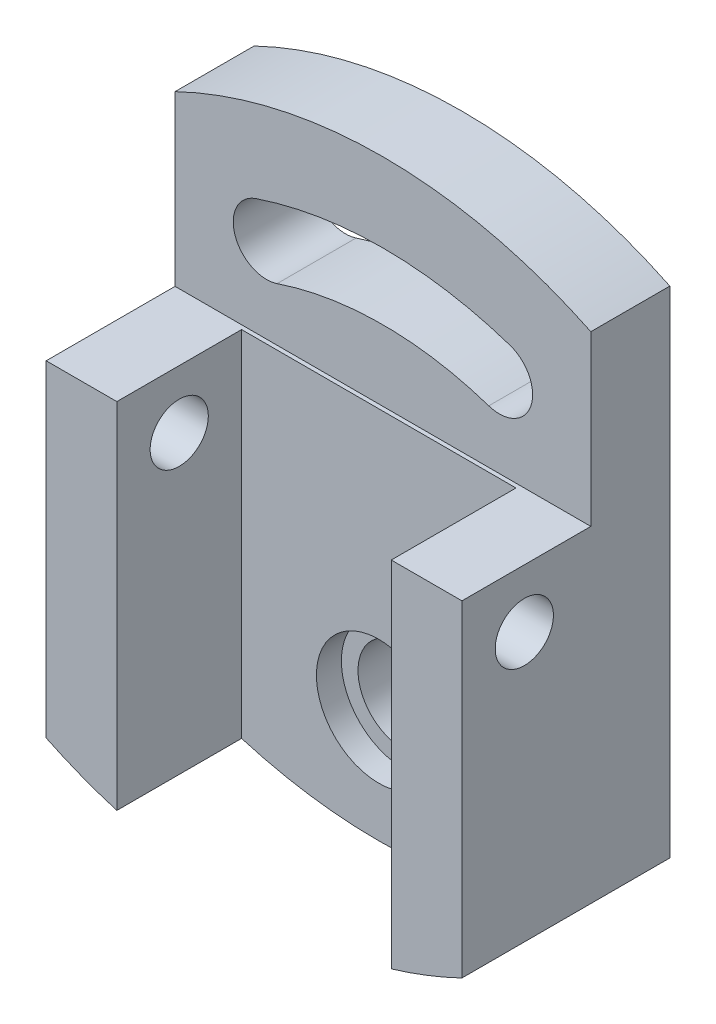
ISO-10303-21;
HEADER;
FILE_DESCRIPTION(('STEP AP214'),'2;1');
FILE_NAME('part.step','',(''),(''),'','','');
FILE_SCHEMA(('AUTOMOTIVE_DESIGN { 1 0 10303 214 1 1 1 1 }'));
ENDSEC;
DATA;
#1=APPLICATION_CONTEXT('core data for automotive mechanical design processes');
#2=APPLICATION_PROTOCOL_DEFINITION('international standard','automotive_design',2000,#1);
#3=PRODUCT_CONTEXT('',#1,'mechanical');
#4=PRODUCT('Part','Part','',(#3));
#5=PRODUCT_RELATED_PRODUCT_CATEGORY('part','',(#4));
#6=PRODUCT_DEFINITION_FORMATION('','',#4);
#7=PRODUCT_DEFINITION_CONTEXT('part definition',#1,'design');
#8=PRODUCT_DEFINITION('design','',#6,#7);
#9=PRODUCT_DEFINITION_SHAPE('','',#8);
#10=(LENGTH_UNIT() NAMED_UNIT(*) SI_UNIT(.MILLI.,.METRE.));
#11=(NAMED_UNIT(*) PLANE_ANGLE_UNIT() SI_UNIT($,.RADIAN.));
#12=(NAMED_UNIT(*) SI_UNIT($,.STERADIAN.) SOLID_ANGLE_UNIT());
#13=UNCERTAINTY_MEASURE_WITH_UNIT(LENGTH_MEASURE(1.E-05),#10,'distance_accuracy_value','');
#14=(GEOMETRIC_REPRESENTATION_CONTEXT(3) GLOBAL_UNCERTAINTY_ASSIGNED_CONTEXT((#13)) GLOBAL_UNIT_ASSIGNED_CONTEXT((#10,
#11,#12)) REPRESENTATION_CONTEXT('',''));
#15=CARTESIAN_POINT('',(0.,0.,0.));
#16=DIRECTION('',(0.,0.,1.));
#17=DIRECTION('',(1.,0.,0.));
#18=AXIS2_PLACEMENT_3D('',#15,#16,#17);
#19=CARTESIAN_POINT('',(0.,0.,20.));
#20=DIRECTION('',(0.,0.,-1.));
#21=DIRECTION('',(-1.,0.,0.));
#22=AXIS2_PLACEMENT_3D('',#19,#20,#21);
#23=CYLINDRICAL_SURFACE('',#22,115.);
#24=CARTESIAN_POINT('',(0.,0.,19.));
#25=DIRECTION('',(0.,0.,1.));
#26=DIRECTION('',(1.,0.,0.));
#27=AXIS2_PLACEMENT_3D('',#24,#25,#26);
#28=CIRCLE('',#27,115.);
#29=CARTESIAN_POINT('',(50.,103.56157588604,19.));
#30=VERTEX_POINT('',#29);
#31=CARTESIAN_POINT('',(-50.,103.56157588604,19.));
#32=VERTEX_POINT('',#31);
#33=EDGE_CURVE('E163',#30,#32,#28,.T.);
#34=ORIENTED_EDGE('',*,*,#33,.F.);
#35=DIRECTION('',(0.,0.,-1.));
#36=VECTOR('',#35,1.);
#37=CARTESIAN_POINT('',(50.,103.56157588604,20.));
#38=LINE('',#37,#36);
#39=CARTESIAN_POINT('',(50.,103.56157588604,0.));
#40=VERTEX_POINT('',#39);
#41=EDGE_CURVE('E253',#30,#40,#38,.T.);
#42=ORIENTED_EDGE('',*,*,#41,.T.);
#43=CARTESIAN_POINT('',(0.,0.,0.));
#44=DIRECTION('',(0.,0.,1.));
#45=DIRECTION('',(-1.,0.,0.));
#46=AXIS2_PLACEMENT_3D('',#43,#44,#45);
#47=CIRCLE('',#46,115.);
#48=CARTESIAN_POINT('',(-50.,103.56157588604,0.));
#49=VERTEX_POINT('',#48);
#50=EDGE_CURVE('E245',#40,#49,#47,.T.);
#51=ORIENTED_EDGE('',*,*,#50,.T.);
#52=DIRECTION('',(0.,0.,-1.));
#53=VECTOR('',#52,1.);
#54=CARTESIAN_POINT('',(-50.,103.56157588604,20.));
#55=LINE('',#54,#53);
#56=EDGE_CURVE('E251',#32,#49,#55,.T.);
#57=ORIENTED_EDGE('',*,*,#56,.F.);
#58=EDGE_LOOP('',(#34,#42,#51,#57));
#59=FACE_BOUND('',#58,.T.);
#60=ADVANCED_FACE('F37',(#59),#23,.T.);
#61=CARTESIAN_POINT('',(28.,83.4266144584568,20.));
#62=DIRECTION('',(0.,0.,-1.));
#63=DIRECTION('',(-1.,0.,0.));
#64=AXIS2_PLACEMENT_3D('',#61,#62,#63);
#65=CYLINDRICAL_SURFACE('',#64,7.99999999999999);
#66=DIRECTION('',(0.,0.,-1.));
#67=VECTOR('',#66,1.);
#68=CARTESIAN_POINT('',(25.4545454545455,75.8423767804153,20.));
#69=LINE('',#68,#67);
#70=CARTESIAN_POINT('',(25.4545454545455,75.8423767804153,19.));
#71=VERTEX_POINT('',#70);
#72=CARTESIAN_POINT('',(25.4545454545455,75.8423767804153,0.));
#73=VERTEX_POINT('',#72);
#74=EDGE_CURVE('E227',#71,#73,#69,.T.);
#75=ORIENTED_EDGE('',*,*,#74,.F.);
#76=CARTESIAN_POINT('',(28.,83.4266144584568,19.));
#77=DIRECTION('',(0.,0.,1.));
#78=DIRECTION('',(1.,0.,0.));
#79=AXIS2_PLACEMENT_3D('',#76,#77,#78);
#80=CIRCLE('',#79,7.99999999999999);
#81=CARTESIAN_POINT('',(30.5454545454545,91.0108521364983,19.));
#82=VERTEX_POINT('',#81);
#83=EDGE_CURVE('E53',#71,#82,#80,.T.);
#84=ORIENTED_EDGE('',*,*,#83,.T.);
#85=DIRECTION('',(0.,0.,-1.));
#86=VECTOR('',#85,1.);
#87=CARTESIAN_POINT('',(30.5454545454545,91.0108521364983,20.));
#88=LINE('',#87,#86);
#89=CARTESIAN_POINT('',(30.5454545454545,91.0108521364983,0.));
#90=VERTEX_POINT('',#89);
#91=EDGE_CURVE('E233',#82,#90,#88,.T.);
#92=ORIENTED_EDGE('',*,*,#91,.T.);
#93=CARTESIAN_POINT('',(28.,83.4266144584568,0.));
#94=DIRECTION('',(0.,0.,1.));
#95=DIRECTION('',(1.,0.,0.));
#96=AXIS2_PLACEMENT_3D('',#93,#94,#95);
#97=CIRCLE('',#96,7.99999999999999);
#98=EDGE_CURVE('E215',#73,#90,#97,.T.);
#99=ORIENTED_EDGE('',*,*,#98,.F.);
#100=EDGE_LOOP('',(#75,#84,#92,#99));
#101=FACE_BOUND('',#100,.T.);
#102=ADVANCED_FACE('F296',(#101),#65,.F.);
#103=CARTESIAN_POINT('',(0.,0.,20.));
#104=DIRECTION('',(0.,0.,-1.));
#105=DIRECTION('',(-1.,0.,0.));
#106=AXIS2_PLACEMENT_3D('',#103,#104,#105);
#107=CYLINDRICAL_SURFACE('',#106,96.);
#108=ORIENTED_EDGE('',*,*,#91,.F.);
#109=CARTESIAN_POINT('',(0.,0.,19.));
#110=DIRECTION('',(0.,0.,1.));
#111=DIRECTION('',(1.,0.,0.));
#112=AXIS2_PLACEMENT_3D('',#109,#110,#111);
#113=CIRCLE('',#112,96.);
#114=CARTESIAN_POINT('',(-30.5454545454545,91.0108521364983,19.));
#115=VERTEX_POINT('',#114);
#116=EDGE_CURVE('E177',#82,#115,#113,.T.);
#117=ORIENTED_EDGE('',*,*,#116,.T.);
#118=DIRECTION('',(0.,0.,-1.));
#119=VECTOR('',#118,1.);
#120=CARTESIAN_POINT('',(-30.5454545454545,91.0108521364983,20.));
#121=LINE('',#120,#119);
#122=CARTESIAN_POINT('',(-30.5454545454545,91.0108521364983,0.));
#123=VERTEX_POINT('',#122);
#124=EDGE_CURVE('E231',#115,#123,#121,.T.);
#125=ORIENTED_EDGE('',*,*,#124,.T.);
#126=CARTESIAN_POINT('',(0.,0.,0.));
#127=DIRECTION('',(0.,0.,1.));
#128=DIRECTION('',(1.,0.,0.));
#129=AXIS2_PLACEMENT_3D('',#126,#127,#128);
#130=CIRCLE('',#129,96.);
#131=EDGE_CURVE('E218',#90,#123,#130,.T.);
#132=ORIENTED_EDGE('',*,*,#131,.F.);
#133=EDGE_LOOP('',(#108,#117,#125,#132));
#134=FACE_BOUND('',#133,.T.);
#135=ADVANCED_FACE('F301',(#134),#107,.F.);
#136=CARTESIAN_POINT('',(-28.,83.4266144584568,20.));
#137=DIRECTION('',(0.,0.,-1.));
#138=DIRECTION('',(-1.,0.,0.));
#139=AXIS2_PLACEMENT_3D('',#136,#137,#138);
#140=CYLINDRICAL_SURFACE('',#139,7.99999999999999);
#141=ORIENTED_EDGE('',*,*,#124,.F.);
#142=CARTESIAN_POINT('',(-28.,83.4266144584568,19.));
#143=DIRECTION('',(0.,0.,1.));
#144=DIRECTION('',(1.,0.,0.));
#145=AXIS2_PLACEMENT_3D('',#142,#143,#144);
#146=CIRCLE('',#145,7.99999999999999);
#147=CARTESIAN_POINT('',(-25.4545454545455,75.8423767804153,19.));
#148=VERTEX_POINT('',#147);
#149=EDGE_CURVE('E173',#115,#148,#146,.T.);
#150=ORIENTED_EDGE('',*,*,#149,.T.);
#151=DIRECTION('',(0.,0.,-1.));
#152=VECTOR('',#151,1.);
#153=CARTESIAN_POINT('',(-25.4545454545455,75.8423767804153,20.));
#154=LINE('',#153,#152);
#155=CARTESIAN_POINT('',(-25.4545454545455,75.8423767804153,0.));
#156=VERTEX_POINT('',#155);
#157=EDGE_CURVE('E229',#148,#156,#154,.T.);
#158=ORIENTED_EDGE('',*,*,#157,.T.);
#159=CARTESIAN_POINT('',(-28.,83.4266144584568,0.));
#160=DIRECTION('',(0.,0.,1.));
#161=DIRECTION('',(1.,0.,0.));
#162=AXIS2_PLACEMENT_3D('',#159,#160,#161);
#163=CIRCLE('',#162,7.99999999999999);
#164=EDGE_CURVE('E221',#123,#156,#163,.T.);
#165=ORIENTED_EDGE('',*,*,#164,.F.);
#166=EDGE_LOOP('',(#141,#150,#158,#165));
#167=FACE_BOUND('',#166,.T.);
#168=ADVANCED_FACE('F345',(#167),#140,.F.);
#169=CARTESIAN_POINT('',(0.,0.,20.));
#170=DIRECTION('',(0.,0.,-1.));
#171=DIRECTION('',(-1.,0.,0.));
#172=AXIS2_PLACEMENT_3D('',#169,#170,#171);
#173=CYLINDRICAL_SURFACE('',#172,80.);
#174=ORIENTED_EDGE('',*,*,#157,.F.);
#175=CARTESIAN_POINT('',(0.,0.,19.));
#176=DIRECTION('',(0.,0.,1.));
#177=DIRECTION('',(1.,0.,0.));
#178=AXIS2_PLACEMENT_3D('',#175,#176,#177);
#179=CIRCLE('',#178,80.);
#180=EDGE_CURVE('E11',#148,#71,#179,.F.);
#181=ORIENTED_EDGE('',*,*,#180,.T.);
#182=ORIENTED_EDGE('',*,*,#74,.T.);
#183=CARTESIAN_POINT('',(0.,0.,0.));
#184=DIRECTION('',(0.,0.,-1.));
#185=DIRECTION('',(1.,0.,0.));
#186=AXIS2_PLACEMENT_3D('',#183,#184,#185);
#187=CIRCLE('',#186,80.);
#188=EDGE_CURVE('E224',#156,#73,#187,.T.);
#189=ORIENTED_EDGE('',*,*,#188,.F.);
#190=EDGE_LOOP('',(#174,#181,#182,#189));
#191=FACE_BOUND('',#190,.T.);
#192=ADVANCED_FACE('F338',(#191),#173,.T.);
#193=CARTESIAN_POINT('',(0.,88.,20.));
#194=DIRECTION('',(0.,0.,1.));
#195=DIRECTION('',(1.,0.,0.));
#196=AXIS2_PLACEMENT_3D('',#193,#194,#195);
#197=PLANE('',#196);
#198=CARTESIAN_POINT('',(0.,0.,20.));
#199=DIRECTION('',(0.,0.,1.));
#200=DIRECTION('',(1.,0.,0.));
#201=AXIS2_PLACEMENT_3D('',#198,#199,#200);
#202=CIRCLE('',#201,15.);
#203=CARTESIAN_POINT('',(15.,0.,20.));
#204=VERTEX_POINT('',#203);
#205=EDGE_CURVE('E169',#204,#204,#202,.T.);
#206=ORIENTED_EDGE('',*,*,#205,.F.);
#207=EDGE_LOOP('',(#206));
#208=FACE_BOUND('',#207,.T.);
#209=DIRECTION('',(1.,0.,0.));
#210=VECTOR('',#209,1.);
#211=CARTESIAN_POINT('',(33.,63.,20.));
#212=LINE('',#211,#210);
#213=CARTESIAN_POINT('',(-33.,62.9999999999999,20.));
#214=VERTEX_POINT('',#213);
#215=CARTESIAN_POINT('',(33.,63.,20.));
#216=VERTEX_POINT('',#215);
#217=EDGE_CURVE('E164',#214,#216,#212,.T.);
#218=ORIENTED_EDGE('',*,*,#217,.F.);
#219=DIRECTION('',(0.,1.,0.));
#220=VECTOR('',#219,1.);
#221=CARTESIAN_POINT('',(-33.,63.,20.));
#222=LINE('',#221,#220);
#223=CARTESIAN_POINT('',(-33.,-22.1635148313633,20.));
#224=VERTEX_POINT('',#223);
#225=EDGE_CURVE('E60',#224,#214,#222,.T.);
#226=ORIENTED_EDGE('',*,*,#225,.F.);
#227=CARTESIAN_POINT('',(0.,88.,20.));
#228=DIRECTION('',(0.,0.,1.));
#229=DIRECTION('',(1.,0.,0.));
#230=AXIS2_PLACEMENT_3D('',#227,#228,#229);
#231=CIRCLE('',#230,115.);
#232=CARTESIAN_POINT('',(33.,-22.1635148313633,20.));
#233=VERTEX_POINT('',#232);
#234=EDGE_CURVE('E236',#224,#233,#231,.T.);
#235=ORIENTED_EDGE('',*,*,#234,.T.);
#236=DIRECTION('',(0.,-1.,0.));
#237=VECTOR('',#236,1.);
#238=CARTESIAN_POINT('',(33.,63.,20.));
#239=LINE('',#238,#237);
#240=EDGE_CURVE('E187',#216,#233,#239,.T.);
#241=ORIENTED_EDGE('',*,*,#240,.F.);
#242=EDGE_LOOP('',(#218,#226,#235,#241));
#243=FACE_BOUND('',#242,.T.);
#244=ADVANCED_FACE('F278',(#208,#243),#197,.T.);
#245=CARTESIAN_POINT('',(0.,88.,0.));
#246=DIRECTION('',(0.,0.,1.));
#247=DIRECTION('',(1.,0.,0.));
#248=AXIS2_PLACEMENT_3D('',#245,#246,#247);
#249=PLANE('',#248);
#250=CARTESIAN_POINT('',(0.,0.,0.));
#251=DIRECTION('',(0.,0.,1.));
#252=DIRECTION('',(1.,0.,0.));
#253=AXIS2_PLACEMENT_3D('',#250,#251,#252);
#254=CIRCLE('',#253,11.);
#255=CARTESIAN_POINT('',(11.,0.,0.));
#256=VERTEX_POINT('',#255);
#257=EDGE_CURVE('E326',#256,#256,#254,.T.);
#258=ORIENTED_EDGE('',*,*,#257,.T.);
#259=EDGE_LOOP('',(#258));
#260=FACE_BOUND('',#259,.T.);
#261=CARTESIAN_POINT('',(0.,88.,0.));
#262=DIRECTION('',(0.,0.,1.));
#263=DIRECTION('',(1.,0.,0.));
#264=AXIS2_PLACEMENT_3D('',#261,#262,#263);
#265=CIRCLE('',#264,115.);
#266=CARTESIAN_POINT('',(-50.,-15.5615758860399,0.));
#267=VERTEX_POINT('',#266);
#268=CARTESIAN_POINT('',(50.,-15.5615758860399,0.));
#269=VERTEX_POINT('',#268);
#270=EDGE_CURVE('E235',#267,#269,#265,.T.);
#271=ORIENTED_EDGE('',*,*,#270,.F.);
#272=DIRECTION('',(0.,-1.,0.));
#273=VECTOR('',#272,1.);
#274=CARTESIAN_POINT('',(-50.,103.56157588604,0.));
#275=LINE('',#274,#273);
#276=EDGE_CURVE('E239',#49,#267,#275,.T.);
#277=ORIENTED_EDGE('',*,*,#276,.F.);
#278=ORIENTED_EDGE('',*,*,#50,.F.);
#279=DIRECTION('',(0.,1.,0.));
#280=VECTOR('',#279,1.);
#281=CARTESIAN_POINT('',(50.,103.56157588604,0.));
#282=LINE('',#281,#280);
#283=EDGE_CURVE('E242',#269,#40,#282,.T.);
#284=ORIENTED_EDGE('',*,*,#283,.F.);
#285=EDGE_LOOP('',(#271,#277,#278,#284));
#286=FACE_BOUND('',#285,.T.);
#287=ORIENTED_EDGE('',*,*,#98,.T.);
#288=ORIENTED_EDGE('',*,*,#131,.T.);
#289=ORIENTED_EDGE('',*,*,#164,.T.);
#290=ORIENTED_EDGE('',*,*,#188,.T.);
#291=EDGE_LOOP('',(#287,#288,#289,#290));
#292=FACE_BOUND('',#291,.T.);
#293=ADVANCED_FACE('F267',(#260,#286,#292),#249,.F.);
#294=CARTESIAN_POINT('',(0.,88.,20.));
#295=DIRECTION('',(0.,0.,-1.));
#296=DIRECTION('',(-1.,0.,0.));
#297=AXIS2_PLACEMENT_3D('',#294,#295,#296);
#298=CYLINDRICAL_SURFACE('',#297,115.);
#299=ORIENTED_EDGE('',*,*,#270,.T.);
#300=DIRECTION('',(0.,0.,-1.));
#301=VECTOR('',#300,1.);
#302=CARTESIAN_POINT('',(50.,-15.5615758860399,20.));
#303=LINE('',#302,#301);
#304=CARTESIAN_POINT('',(50.,-15.5615758860399,50.));
#305=VERTEX_POINT('',#304);
#306=EDGE_CURVE('E46',#305,#269,#303,.T.);
#307=ORIENTED_EDGE('',*,*,#306,.F.);
#308=CARTESIAN_POINT('',(0.,88.,50.));
#309=DIRECTION('',(0.,0.,1.));
#310=DIRECTION('',(1.,0.,0.));
#311=AXIS2_PLACEMENT_3D('',#308,#309,#310);
#312=CIRCLE('',#311,115.);
#313=CARTESIAN_POINT('',(33.,-22.1635148313633,50.));
#314=VERTEX_POINT('',#313);
#315=EDGE_CURVE('E201',#314,#305,#312,.T.);
#316=ORIENTED_EDGE('',*,*,#315,.F.);
#317=DIRECTION('',(0.,0.,-1.));
#318=VECTOR('',#317,1.);
#319=CARTESIAN_POINT('',(33.,-22.1635148313633,50.));
#320=LINE('',#319,#318);
#321=EDGE_CURVE('E209',#314,#233,#320,.T.);
#322=ORIENTED_EDGE('',*,*,#321,.T.);
#323=ORIENTED_EDGE('',*,*,#234,.F.);
#324=DIRECTION('',(0.,0.,-1.));
#325=VECTOR('',#324,1.);
#326=CARTESIAN_POINT('',(-33.,-22.1635148313633,50.));
#327=LINE('',#326,#325);
#328=CARTESIAN_POINT('',(-33.,-22.1635148313633,50.));
#329=VERTEX_POINT('',#328);
#330=EDGE_CURVE('E181',#329,#224,#327,.T.);
#331=ORIENTED_EDGE('',*,*,#330,.F.);
#332=CARTESIAN_POINT('',(0.,88.,50.));
#333=DIRECTION('',(0.,0.,1.));
#334=DIRECTION('',(1.,0.,0.));
#335=AXIS2_PLACEMENT_3D('',#332,#333,#334);
#336=CIRCLE('',#335,115.);
#337=CARTESIAN_POINT('',(-50.,-15.5615758860399,50.));
#338=VERTEX_POINT('',#337);
#339=EDGE_CURVE('E188',#338,#329,#336,.T.);
#340=ORIENTED_EDGE('',*,*,#339,.F.);
#341=DIRECTION('',(0.,0.,-1.));
#342=VECTOR('',#341,1.);
#343=CARTESIAN_POINT('',(-50.,-15.5615758860399,20.));
#344=LINE('',#343,#342);
#345=EDGE_CURVE('E238',#338,#267,#344,.T.);
#346=ORIENTED_EDGE('',*,*,#345,.T.);
#347=EDGE_LOOP('',(#299,#307,#316,#322,#323,#331,#340,#346));
#348=FACE_BOUND('',#347,.T.);
#349=ADVANCED_FACE('F39',(#348),#298,.T.);
#350=CARTESIAN_POINT('',(50.,103.56157588604,20.));
#351=DIRECTION('',(-1.,0.,0.));
#352=DIRECTION('',(0.,0.,1.));
#353=AXIS2_PLACEMENT_3D('',#350,#351,#352);
#354=PLANE('',#353);
#355=CARTESIAN_POINT('',(50.,49.,35.));
#356=DIRECTION('',(1.,0.,0.));
#357=DIRECTION('',(0.,0.,-1.));
#358=AXIS2_PLACEMENT_3D('',#355,#356,#357);
#359=CIRCLE('',#358,7.);
#360=CARTESIAN_POINT('',(50.,49.,28.));
#361=VERTEX_POINT('',#360);
#362=EDGE_CURVE('E315',#361,#361,#359,.T.);
#363=ORIENTED_EDGE('',*,*,#362,.F.);
#364=EDGE_LOOP('',(#363));
#365=FACE_BOUND('',#364,.T.);
#366=DIRECTION('',(0.,1.,0.));
#367=VECTOR('',#366,1.);
#368=CARTESIAN_POINT('',(50.,63.,19.));
#369=LINE('',#368,#367);
#370=CARTESIAN_POINT('',(50.,63.,19.));
#371=VERTEX_POINT('',#370);
#372=EDGE_CURVE('E159',#371,#30,#369,.T.);
#373=ORIENTED_EDGE('',*,*,#372,.F.);
#374=DIRECTION('',(0.,0.,-1.));
#375=VECTOR('',#374,1.);
#376=CARTESIAN_POINT('',(50.,63.,50.));
#377=LINE('',#376,#375);
#378=CARTESIAN_POINT('',(50.,63.,50.));
#379=VERTEX_POINT('',#378);
#380=EDGE_CURVE('E156',#379,#371,#377,.T.);
#381=ORIENTED_EDGE('',*,*,#380,.F.);
#382=DIRECTION('',(0.,1.,0.));
#383=VECTOR('',#382,1.);
#384=CARTESIAN_POINT('',(50.,-15.5615758860399,50.));
#385=LINE('',#384,#383);
#386=EDGE_CURVE('E204',#305,#379,#385,.T.);
#387=ORIENTED_EDGE('',*,*,#386,.F.);
#388=ORIENTED_EDGE('',*,*,#306,.T.);
#389=ORIENTED_EDGE('',*,*,#283,.T.);
#390=ORIENTED_EDGE('',*,*,#41,.F.);
#391=EDGE_LOOP('',(#373,#381,#387,#388,#389,#390));
#392=FACE_BOUND('',#391,.T.);
#393=ADVANCED_FACE('F258',(#365,#392),#354,.F.);
#394=CARTESIAN_POINT('',(-50.,103.56157588604,20.));
#395=DIRECTION('',(1.,0.,0.));
#396=DIRECTION('',(0.,1.,0.));
#397=AXIS2_PLACEMENT_3D('',#394,#395,#396);
#398=PLANE('',#397);
#399=CARTESIAN_POINT('',(-50.,49.,35.));
#400=DIRECTION('',(1.,0.,0.));
#401=DIRECTION('',(0.,0.,-1.));
#402=AXIS2_PLACEMENT_3D('',#399,#400,#401);
#403=CIRCLE('',#402,7.);
#404=CARTESIAN_POINT('',(-50.,49.,28.));
#405=VERTEX_POINT('',#404);
#406=EDGE_CURVE('E317',#405,#405,#403,.T.);
#407=ORIENTED_EDGE('',*,*,#406,.T.);
#408=EDGE_LOOP('',(#407));
#409=FACE_BOUND('',#408,.T.);
#410=DIRECTION('',(0.,0.,-1.));
#411=VECTOR('',#410,1.);
#412=CARTESIAN_POINT('',(-50.,63.,50.));
#413=LINE('',#412,#411);
#414=CARTESIAN_POINT('',(-50.,63.,50.));
#415=VERTEX_POINT('',#414);
#416=CARTESIAN_POINT('',(-50.,63.,19.));
#417=VERTEX_POINT('',#416);
#418=EDGE_CURVE('E139',#415,#417,#413,.T.);
#419=ORIENTED_EDGE('',*,*,#418,.T.);
#420=DIRECTION('',(0.,-1.,0.));
#421=VECTOR('',#420,1.);
#422=CARTESIAN_POINT('',(-50.,103.56157588604,19.));
#423=LINE('',#422,#421);
#424=EDGE_CURVE('E143',#32,#417,#423,.T.);
#425=ORIENTED_EDGE('',*,*,#424,.F.);
#426=ORIENTED_EDGE('',*,*,#56,.T.);
#427=ORIENTED_EDGE('',*,*,#276,.T.);
#428=ORIENTED_EDGE('',*,*,#345,.F.);
#429=DIRECTION('',(0.,-1.,0.));
#430=VECTOR('',#429,1.);
#431=CARTESIAN_POINT('',(-50.,63.,50.));
#432=LINE('',#431,#430);
#433=EDGE_CURVE('E146',#415,#338,#432,.T.);
#434=ORIENTED_EDGE('',*,*,#433,.F.);
#435=EDGE_LOOP('',(#419,#425,#426,#427,#428,#434));
#436=FACE_BOUND('',#435,.T.);
#437=ADVANCED_FACE('F141',(#409,#436),#398,.F.);
#438=CARTESIAN_POINT('',(33.,63.,50.));
#439=DIRECTION('',(0.,-1.,0.));
#440=DIRECTION('',(0.,0.,-1.));
#441=AXIS2_PLACEMENT_3D('',#438,#439,#440);
#442=PLANE('',#441);
#443=ORIENTED_EDGE('',*,*,#380,.T.);
#444=DIRECTION('',(1.,0.,0.));
#445=VECTOR('',#444,1.);
#446=CARTESIAN_POINT('',(-50.,63.,19.));
#447=LINE('',#446,#445);
#448=EDGE_CURVE('E152',#417,#371,#447,.T.);
#449=ORIENTED_EDGE('',*,*,#448,.F.);
#450=ORIENTED_EDGE('',*,*,#418,.F.);
#451=DIRECTION('',(-1.,0.,0.));
#452=VECTOR('',#451,1.);
#453=CARTESIAN_POINT('',(-50.,63.,50.));
#454=LINE('',#453,#452);
#455=CARTESIAN_POINT('',(-33.,63.,50.));
#456=VERTEX_POINT('',#455);
#457=EDGE_CURVE('E190',#456,#415,#454,.T.);
#458=ORIENTED_EDGE('',*,*,#457,.F.);
#459=DIRECTION('',(0.,0.,-1.));
#460=VECTOR('',#459,1.);
#461=CARTESIAN_POINT('',(-33.,63.,50.));
#462=LINE('',#461,#460);
#463=EDGE_CURVE('E149',#456,#214,#462,.T.);
#464=ORIENTED_EDGE('',*,*,#463,.T.);
#465=ORIENTED_EDGE('',*,*,#217,.T.);
#466=DIRECTION('',(0.,0.,-1.));
#467=VECTOR('',#466,1.);
#468=CARTESIAN_POINT('',(33.,63.,50.));
#469=LINE('',#468,#467);
#470=CARTESIAN_POINT('',(33.,63.,50.));
#471=VERTEX_POINT('',#470);
#472=EDGE_CURVE('E212',#471,#216,#469,.T.);
#473=ORIENTED_EDGE('',*,*,#472,.F.);
#474=DIRECTION('',(-1.,0.,0.));
#475=VECTOR('',#474,1.);
#476=CARTESIAN_POINT('',(33.,63.,50.));
#477=LINE('',#476,#475);
#478=EDGE_CURVE('E196',#379,#471,#477,.T.);
#479=ORIENTED_EDGE('',*,*,#478,.F.);
#480=EDGE_LOOP('',(#443,#449,#450,#458,#464,#465,#473,#479));
#481=FACE_BOUND('',#480,.T.);
#482=ADVANCED_FACE('F153',(#481),#442,.F.);
#483=CARTESIAN_POINT('',(33.,63.,50.));
#484=DIRECTION('',(1.,0.,0.));
#485=DIRECTION('',(0.,1.,0.));
#486=AXIS2_PLACEMENT_3D('',#483,#484,#485);
#487=PLANE('',#486);
#488=CARTESIAN_POINT('',(33.,49.,35.));
#489=DIRECTION('',(1.,0.,0.));
#490=DIRECTION('',(0.,1.,0.));
#491=AXIS2_PLACEMENT_3D('',#488,#489,#490);
#492=CIRCLE('',#491,7.);
#493=CARTESIAN_POINT('',(33.,56.,35.));
#494=VERTEX_POINT('',#493);
#495=EDGE_CURVE('E322',#494,#494,#492,.T.);
#496=ORIENTED_EDGE('',*,*,#495,.T.);
#497=EDGE_LOOP('',(#496));
#498=FACE_BOUND('',#497,.T.);
#499=ORIENTED_EDGE('',*,*,#240,.T.);
#500=ORIENTED_EDGE('',*,*,#321,.F.);
#501=DIRECTION('',(0.,-1.,0.));
#502=VECTOR('',#501,1.);
#503=CARTESIAN_POINT('',(33.,63.,50.));
#504=LINE('',#503,#502);
#505=EDGE_CURVE('E199',#471,#314,#504,.T.);
#506=ORIENTED_EDGE('',*,*,#505,.F.);
#507=ORIENTED_EDGE('',*,*,#472,.T.);
#508=EDGE_LOOP('',(#499,#500,#506,#507));
#509=FACE_BOUND('',#508,.T.);
#510=ADVANCED_FACE('F276',(#498,#509),#487,.F.);
#511=CARTESIAN_POINT('',(0.,88.,50.));
#512=DIRECTION('',(0.,0.,1.));
#513=DIRECTION('',(1.,0.,0.));
#514=AXIS2_PLACEMENT_3D('',#511,#512,#513);
#515=PLANE('',#514);
#516=ORIENTED_EDGE('',*,*,#478,.T.);
#517=ORIENTED_EDGE('',*,*,#505,.T.);
#518=ORIENTED_EDGE('',*,*,#315,.T.);
#519=ORIENTED_EDGE('',*,*,#386,.T.);
#520=EDGE_LOOP('',(#516,#517,#518,#519));
#521=FACE_BOUND('',#520,.T.);
#522=ADVANCED_FACE('F272',(#521),#515,.T.);
#523=CARTESIAN_POINT('',(-33.,63.,50.));
#524=DIRECTION('',(-1.,0.,0.));
#525=DIRECTION('',(0.,0.,1.));
#526=AXIS2_PLACEMENT_3D('',#523,#524,#525);
#527=PLANE('',#526);
#528=CARTESIAN_POINT('',(-33.,49.,35.));
#529=DIRECTION('',(-1.,0.,0.));
#530=DIRECTION('',(0.,0.,1.));
#531=AXIS2_PLACEMENT_3D('',#528,#529,#530);
#532=CIRCLE('',#531,7.);
#533=CARTESIAN_POINT('',(-33.,49.,42.));
#534=VERTEX_POINT('',#533);
#535=EDGE_CURVE('E41',#534,#534,#532,.T.);
#536=ORIENTED_EDGE('',*,*,#535,.T.);
#537=EDGE_LOOP('',(#536));
#538=FACE_BOUND('',#537,.T.);
#539=ORIENTED_EDGE('',*,*,#225,.T.);
#540=ORIENTED_EDGE('',*,*,#463,.F.);
#541=DIRECTION('',(0.,1.,0.));
#542=VECTOR('',#541,1.);
#543=CARTESIAN_POINT('',(-33.,63.,50.));
#544=LINE('',#543,#542);
#545=EDGE_CURVE('E192',#329,#456,#544,.T.);
#546=ORIENTED_EDGE('',*,*,#545,.F.);
#547=ORIENTED_EDGE('',*,*,#330,.T.);
#548=EDGE_LOOP('',(#539,#540,#546,#547));
#549=FACE_BOUND('',#548,.T.);
#550=ADVANCED_FACE('F281',(#538,#549),#527,.F.);
#551=CARTESIAN_POINT('',(0.,88.,50.));
#552=DIRECTION('',(0.,0.,1.));
#553=DIRECTION('',(1.,0.,0.));
#554=AXIS2_PLACEMENT_3D('',#551,#552,#553);
#555=PLANE('',#554);
#556=ORIENTED_EDGE('',*,*,#339,.T.);
#557=ORIENTED_EDGE('',*,*,#545,.T.);
#558=ORIENTED_EDGE('',*,*,#457,.T.);
#559=ORIENTED_EDGE('',*,*,#433,.T.);
#560=EDGE_LOOP('',(#556,#557,#558,#559));
#561=FACE_BOUND('',#560,.T.);
#562=ADVANCED_FACE('F283',(#561),#555,.T.);
#563=CARTESIAN_POINT('',(0.,0.,19.));
#564=DIRECTION('',(0.,0.,1.));
#565=DIRECTION('',(1.,0.,0.));
#566=AXIS2_PLACEMENT_3D('',#563,#564,#565);
#567=PLANE('',#566);
#568=ORIENTED_EDGE('',*,*,#180,.F.);
#569=ORIENTED_EDGE('',*,*,#149,.F.);
#570=ORIENTED_EDGE('',*,*,#116,.F.);
#571=ORIENTED_EDGE('',*,*,#83,.F.);
#572=EDGE_LOOP('',(#568,#569,#570,#571));
#573=FACE_BOUND('',#572,.T.);
#574=ORIENTED_EDGE('',*,*,#424,.T.);
#575=ORIENTED_EDGE('',*,*,#448,.T.);
#576=ORIENTED_EDGE('',*,*,#372,.T.);
#577=ORIENTED_EDGE('',*,*,#33,.T.);
#578=EDGE_LOOP('',(#574,#575,#576,#577));
#579=FACE_BOUND('',#578,.T.);
#580=ADVANCED_FACE('F161',(#573,#579),#567,.T.);
#581=CARTESIAN_POINT('',(0.,0.,14.));
#582=DIRECTION('',(0.,0.,1.));
#583=DIRECTION('',(1.,0.,0.));
#584=AXIS2_PLACEMENT_3D('',#581,#582,#583);
#585=CYLINDRICAL_SURFACE('',#584,15.);
#586=CARTESIAN_POINT('',(0.,0.,14.));
#587=DIRECTION('',(0.,0.,1.));
#588=DIRECTION('',(1.,0.,0.));
#589=AXIS2_PLACEMENT_3D('',#586,#587,#588);
#590=CIRCLE('',#589,15.);
#591=CARTESIAN_POINT('',(15.,0.,14.));
#592=VERTEX_POINT('',#591);
#593=EDGE_CURVE('E166',#592,#592,#590,.T.);
#594=ORIENTED_EDGE('',*,*,#593,.F.);
#595=EDGE_LOOP('',(#594));
#596=FACE_BOUND('',#595,.T.);
#597=ORIENTED_EDGE('',*,*,#205,.T.);
#598=EDGE_LOOP('',(#597));
#599=FACE_BOUND('',#598,.T.);
#600=ADVANCED_FACE('F290',(#596,#599),#585,.F.);
#601=CARTESIAN_POINT('',(0.,0.,14.));
#602=DIRECTION('',(0.,0.,1.));
#603=DIRECTION('',(1.,0.,0.));
#604=AXIS2_PLACEMENT_3D('',#601,#602,#603);
#605=PLANE('',#604);
#606=CARTESIAN_POINT('',(0.,0.,14.));
#607=DIRECTION('',(0.,0.,1.));
#608=DIRECTION('',(1.,0.,0.));
#609=AXIS2_PLACEMENT_3D('',#606,#607,#608);
#610=CIRCLE('',#609,11.);
#611=CARTESIAN_POINT('',(11.,0.,14.));
#612=VERTEX_POINT('',#611);
#613=EDGE_CURVE('E325',#612,#612,#610,.T.);
#614=ORIENTED_EDGE('',*,*,#613,.F.);
#615=EDGE_LOOP('',(#614));
#616=FACE_BOUND('',#615,.T.);
#617=ORIENTED_EDGE('',*,*,#593,.T.);
#618=EDGE_LOOP('',(#617));
#619=FACE_BOUND('',#618,.T.);
#620=ADVANCED_FACE('F406',(#616,#619),#605,.T.);
#621=CARTESIAN_POINT('',(0.,0.,0.));
#622=DIRECTION('',(0.,0.,1.));
#623=DIRECTION('',(1.,0.,0.));
#624=AXIS2_PLACEMENT_3D('',#621,#622,#623);
#625=CYLINDRICAL_SURFACE('',#624,11.);
#626=ORIENTED_EDGE('',*,*,#257,.F.);
#627=EDGE_LOOP('',(#626));
#628=FACE_BOUND('',#627,.T.);
#629=ORIENTED_EDGE('',*,*,#613,.T.);
#630=EDGE_LOOP('',(#629));
#631=FACE_BOUND('',#630,.T.);
#632=ADVANCED_FACE('F385',(#628,#631),#625,.F.);
#633=CARTESIAN_POINT('',(-50.,49.,35.));
#634=DIRECTION('',(1.,0.,0.));
#635=DIRECTION('',(0.,0.,-1.));
#636=AXIS2_PLACEMENT_3D('',#633,#634,#635);
#637=CYLINDRICAL_SURFACE('',#636,7.);
#638=ORIENTED_EDGE('',*,*,#406,.F.);
#639=EDGE_LOOP('',(#638));
#640=FACE_BOUND('',#639,.T.);
#641=ORIENTED_EDGE('',*,*,#535,.F.);
#642=EDGE_LOOP('',(#641));
#643=FACE_BOUND('',#642,.T.);
#644=ADVANCED_FACE('F379',(#640,#643),#637,.F.);
#645=ORIENTED_EDGE('',*,*,#362,.T.);
#646=EDGE_LOOP('',(#645));
#647=FACE_BOUND('',#646,.T.);
#648=ORIENTED_EDGE('',*,*,#495,.F.);
#649=EDGE_LOOP('',(#648));
#650=FACE_BOUND('',#649,.T.);
#651=ADVANCED_FACE('F384',(#647,#650),#637,.F.);
#652=CLOSED_SHELL('',(#60,#102,#135,#168,#192,#244,#293,#349,#393,#437,#482,#510,#522,#550,#562,
#580,#600,#620,#632,#644,#651));
#653=MANIFOLD_SOLID_BREP('B2',#652);
#654=ADVANCED_BREP_SHAPE_REPRESENTATION('',(#18,#653),#14);
#655=SHAPE_DEFINITION_REPRESENTATION(#9,#654);
ENDSEC;
END-ISO-10303-21;
